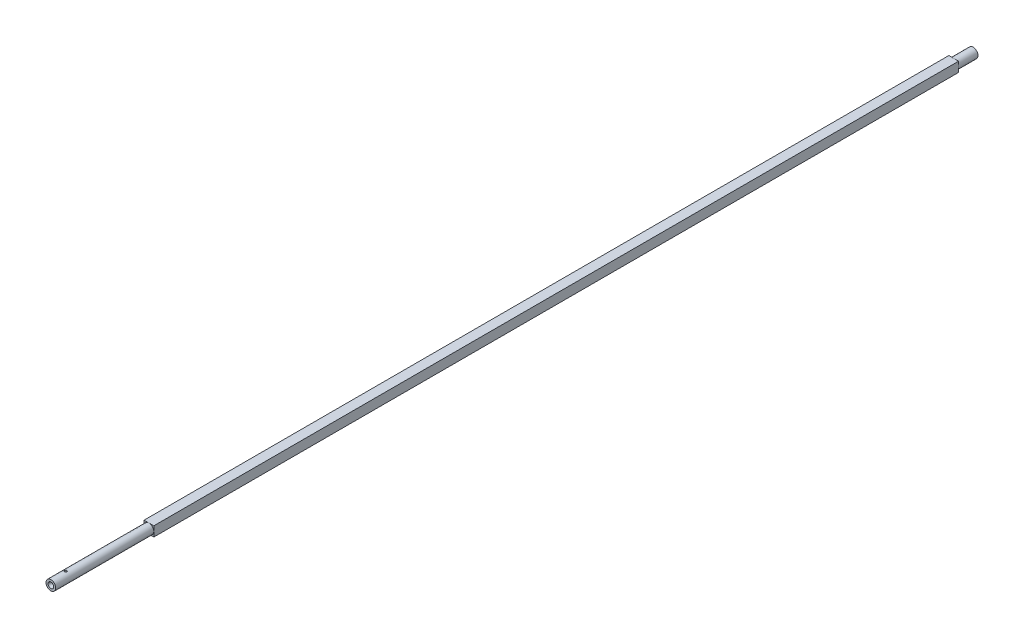
ISO-10303-21;
HEADER;
FILE_DESCRIPTION(('STEP AP214'),'2;1');
FILE_NAME('part.step','',(''),(''),'','','');
FILE_SCHEMA(('AUTOMOTIVE_DESIGN { 1 0 10303 214 1 1 1 1 }'));
ENDSEC;
DATA;
#1=APPLICATION_CONTEXT('core data for automotive mechanical design processes');
#2=APPLICATION_PROTOCOL_DEFINITION('international standard','automotive_design',2000,#1);
#3=PRODUCT_CONTEXT('',#1,'mechanical');
#4=PRODUCT('Part','Part','',(#3));
#5=PRODUCT_RELATED_PRODUCT_CATEGORY('part','',(#4));
#6=PRODUCT_DEFINITION_FORMATION('','',#4);
#7=PRODUCT_DEFINITION_CONTEXT('part definition',#1,'design');
#8=PRODUCT_DEFINITION('design','',#6,#7);
#9=PRODUCT_DEFINITION_SHAPE('','',#8);
#10=(LENGTH_UNIT() NAMED_UNIT(*) SI_UNIT(.MILLI.,.METRE.));
#11=(NAMED_UNIT(*) PLANE_ANGLE_UNIT() SI_UNIT($,.RADIAN.));
#12=(NAMED_UNIT(*) SI_UNIT($,.STERADIAN.) SOLID_ANGLE_UNIT());
#13=UNCERTAINTY_MEASURE_WITH_UNIT(LENGTH_MEASURE(1.E-05),#10,'distance_accuracy_value','');
#14=(GEOMETRIC_REPRESENTATION_CONTEXT(3) GLOBAL_UNCERTAINTY_ASSIGNED_CONTEXT((#13)) GLOBAL_UNIT_ASSIGNED_CONTEXT((#10,
#11,#12)) REPRESENTATION_CONTEXT('',''));
#15=CARTESIAN_POINT('',(0.,0.,0.));
#16=DIRECTION('',(0.,0.,1.));
#17=DIRECTION('',(1.,0.,0.));
#18=AXIS2_PLACEMENT_3D('',#15,#16,#17);
#19=CARTESIAN_POINT('',(0.,0.,0.));
#20=DIRECTION('',(0.,0.,-1.));
#21=DIRECTION('',(-1.,0.,0.));
#22=AXIS2_PLACEMENT_3D('',#19,#20,#21);
#23=CYLINDRICAL_SURFACE('',#22,3.155);
#24=CARTESIAN_POINT('',(0.,0.,-584.64));
#25=DIRECTION('',(0.,0.,-1.));
#26=DIRECTION('',(-1.,0.,0.));
#27=AXIS2_PLACEMENT_3D('',#24,#25,#26);
#28=CIRCLE('',#27,3.155);
#29=CARTESIAN_POINT('',(-3.155,0.,-584.64));
#30=VERTEX_POINT('',#29);
#31=EDGE_CURVE('E11',#30,#30,#28,.F.);
#32=ORIENTED_EDGE('',*,*,#31,.F.);
#33=EDGE_LOOP('',(#32));
#34=FACE_BOUND('',#33,.T.);
#35=CARTESIAN_POINT('',(0.,0.,-597.2));
#36=DIRECTION('',(0.,0.,-1.));
#37=DIRECTION('',(-1.,0.,0.));
#38=AXIS2_PLACEMENT_3D('',#35,#36,#37);
#39=CIRCLE('',#38,3.155);
#40=CARTESIAN_POINT('',(-3.155,0.,-597.2));
#41=VERTEX_POINT('',#40);
#42=EDGE_CURVE('E116',#41,#41,#39,.T.);
#43=ORIENTED_EDGE('',*,*,#42,.F.);
#44=EDGE_LOOP('',(#43));
#45=FACE_BOUND('',#44,.T.);
#46=ADVANCED_FACE('F31',(#34,#45),#23,.T.);
#47=CARTESIAN_POINT('',(0.,1.805,-597.2));
#48=DIRECTION('',(0.,0.,-1.));
#49=DIRECTION('',(-1.,0.,0.));
#50=AXIS2_PLACEMENT_3D('',#47,#48,#49);
#51=PLANE('',#50);
#52=ORIENTED_EDGE('',*,*,#42,.T.);
#53=EDGE_LOOP('',(#52));
#54=FACE_BOUND('',#53,.T.);
#55=CARTESIAN_POINT('',(0.,0.,-597.2));
#56=DIRECTION('',(0.,0.,-1.));
#57=DIRECTION('',(-1.,0.,0.));
#58=AXIS2_PLACEMENT_3D('',#55,#56,#57);
#59=CIRCLE('',#58,1.805);
#60=CARTESIAN_POINT('',(-1.805,0.,-597.2));
#61=VERTEX_POINT('',#60);
#62=EDGE_CURVE('E125',#61,#61,#59,.T.);
#63=ORIENTED_EDGE('',*,*,#62,.F.);
#64=EDGE_LOOP('',(#63));
#65=FACE_BOUND('',#64,.T.);
#66=ADVANCED_FACE('F33',(#54,#65),#51,.T.);
#67=CARTESIAN_POINT('',(0.,0.,-592.2));
#68=DIRECTION('',(0.,0.,-1.));
#69=DIRECTION('',(-1.,0.,0.));
#70=AXIS2_PLACEMENT_3D('',#67,#68,#69);
#71=CONICAL_SURFACE('',#70,0.,0.346440567429859);
#72=ORIENTED_EDGE('',*,*,#62,.T.);
#73=EDGE_LOOP('',(#72));
#74=FACE_BOUND('',#73,.T.);
#75=CARTESIAN_POINT('',(0.,0.,-592.2));
#76=VERTEX_POINT('',#75);
#77=VERTEX_LOOP('',#76);
#78=FACE_BOUND('',#77,.T.);
#79=ADVANCED_FACE('F160',(#74,#78),#71,.F.);
#80=CARTESIAN_POINT('',(0.,0.,-584.64));
#81=DIRECTION('',(0.,0.,-1.));
#82=DIRECTION('',(-1.,0.,0.));
#83=AXIS2_PLACEMENT_3D('',#80,#81,#82);
#84=PLANE('',#83);
#85=ORIENTED_EDGE('',*,*,#31,.T.);
#86=EDGE_LOOP('',(#85));
#87=FACE_BOUND('',#86,.T.);
#88=DIRECTION('',(0.,-1.,0.));
#89=VECTOR('',#88,1.);
#90=CARTESIAN_POINT('',(-3.16,3.16,-584.64));
#91=LINE('',#90,#89);
#92=CARTESIAN_POINT('',(-3.16,3.16,-584.64));
#93=VERTEX_POINT('',#92);
#94=CARTESIAN_POINT('',(-3.16,-3.16,-584.64));
#95=VERTEX_POINT('',#94);
#96=EDGE_CURVE('E109',#93,#95,#91,.T.);
#97=ORIENTED_EDGE('',*,*,#96,.F.);
#98=DIRECTION('',(-1.,0.,0.));
#99=VECTOR('',#98,1.);
#100=CARTESIAN_POINT('',(-3.16,3.16,-584.64));
#101=LINE('',#100,#99);
#102=CARTESIAN_POINT('',(3.16,3.16,-584.64));
#103=VERTEX_POINT('',#102);
#104=EDGE_CURVE('E84',#103,#93,#101,.T.);
#105=ORIENTED_EDGE('',*,*,#104,.F.);
#106=DIRECTION('',(0.,1.,0.));
#107=VECTOR('',#106,1.);
#108=CARTESIAN_POINT('',(3.16,3.16,-584.64));
#109=LINE('',#108,#107);
#110=CARTESIAN_POINT('',(3.16,-3.16,-584.64));
#111=VERTEX_POINT('',#110);
#112=EDGE_CURVE('E77',#111,#103,#109,.T.);
#113=ORIENTED_EDGE('',*,*,#112,.F.);
#114=DIRECTION('',(1.,0.,0.));
#115=VECTOR('',#114,1.);
#116=CARTESIAN_POINT('',(-3.16,-3.16,-584.64));
#117=LINE('',#116,#115);
#118=EDGE_CURVE('E81',#95,#111,#117,.T.);
#119=ORIENTED_EDGE('',*,*,#118,.F.);
#120=EDGE_LOOP('',(#97,#105,#113,#119));
#121=FACE_BOUND('',#120,.T.);
#122=ADVANCED_FACE('F79',(#87,#121),#84,.T.);
#123=CARTESIAN_POINT('',(-3.16,-3.16,-63.5));
#124=DIRECTION('',(0.,0.,1.));
#125=DIRECTION('',(1.,0.,0.));
#126=AXIS2_PLACEMENT_3D('',#123,#124,#125);
#127=PLANE('',#126);
#128=CARTESIAN_POINT('',(0.,0.,-63.5));
#129=DIRECTION('',(0.,0.,1.));
#130=DIRECTION('',(1.,0.,0.));
#131=AXIS2_PLACEMENT_3D('',#128,#129,#130);
#132=CIRCLE('',#131,3.155);
#133=CARTESIAN_POINT('',(3.155,0.,-63.5));
#134=VERTEX_POINT('',#133);
#135=EDGE_CURVE('E44',#134,#134,#132,.F.);
#136=ORIENTED_EDGE('',*,*,#135,.T.);
#137=EDGE_LOOP('',(#136));
#138=FACE_BOUND('',#137,.T.);
#139=DIRECTION('',(0.,-1.,0.));
#140=VECTOR('',#139,1.);
#141=CARTESIAN_POINT('',(-3.16,3.16,-63.5));
#142=LINE('',#141,#140);
#143=CARTESIAN_POINT('',(-3.16,3.16,-63.5));
#144=VERTEX_POINT('',#143);
#145=CARTESIAN_POINT('',(-3.16,-3.16,-63.5));
#146=VERTEX_POINT('',#145);
#147=EDGE_CURVE('E107',#144,#146,#142,.T.);
#148=ORIENTED_EDGE('',*,*,#147,.T.);
#149=DIRECTION('',(1.,0.,0.));
#150=VECTOR('',#149,1.);
#151=CARTESIAN_POINT('',(-3.16,-3.16,-63.5));
#152=LINE('',#151,#150);
#153=CARTESIAN_POINT('',(3.16,-3.16,-63.5));
#154=VERTEX_POINT('',#153);
#155=EDGE_CURVE('E193',#146,#154,#152,.T.);
#156=ORIENTED_EDGE('',*,*,#155,.T.);
#157=DIRECTION('',(0.,1.,0.));
#158=VECTOR('',#157,1.);
#159=CARTESIAN_POINT('',(3.16,3.16,-63.5));
#160=LINE('',#159,#158);
#161=CARTESIAN_POINT('',(3.16,3.16,-63.5));
#162=VERTEX_POINT('',#161);
#163=EDGE_CURVE('E93',#154,#162,#160,.T.);
#164=ORIENTED_EDGE('',*,*,#163,.T.);
#165=DIRECTION('',(-1.,0.,0.));
#166=VECTOR('',#165,1.);
#167=CARTESIAN_POINT('',(-3.16,3.16,-63.5));
#168=LINE('',#167,#166);
#169=EDGE_CURVE('E101',#162,#144,#168,.T.);
#170=ORIENTED_EDGE('',*,*,#169,.T.);
#171=EDGE_LOOP('',(#148,#156,#164,#170));
#172=FACE_BOUND('',#171,.T.);
#173=ADVANCED_FACE('F142',(#138,#172),#127,.T.);
#174=CARTESIAN_POINT('',(-3.16,-3.16,-593.577829714198));
#175=DIRECTION('',(0.,-1.,0.));
#176=DIRECTION('',(0.,0.,-1.));
#177=AXIS2_PLACEMENT_3D('',#174,#175,#176);
#178=PLANE('',#177);
#179=DIRECTION('',(0.,0.,1.));
#180=VECTOR('',#179,1.);
#181=CARTESIAN_POINT('',(-3.16,-3.16,-593.577829714198));
#182=LINE('',#181,#180);
#183=EDGE_CURVE('E100',#95,#146,#182,.T.);
#184=ORIENTED_EDGE('',*,*,#183,.F.);
#185=ORIENTED_EDGE('',*,*,#118,.T.);
#186=DIRECTION('',(0.,0.,1.));
#187=VECTOR('',#186,1.);
#188=CARTESIAN_POINT('',(3.16,-3.16,-593.577829714198));
#189=LINE('',#188,#187);
#190=EDGE_CURVE('E88',#111,#154,#189,.T.);
#191=ORIENTED_EDGE('',*,*,#190,.T.);
#192=ORIENTED_EDGE('',*,*,#155,.F.);
#193=EDGE_LOOP('',(#184,#185,#191,#192));
#194=FACE_BOUND('',#193,.T.);
#195=ADVANCED_FACE('F99',(#194),#178,.T.);
#196=CARTESIAN_POINT('',(3.16,3.16,-593.577829714198));
#197=DIRECTION('',(1.,0.,0.));
#198=DIRECTION('',(0.,0.,-1.));
#199=AXIS2_PLACEMENT_3D('',#196,#197,#198);
#200=PLANE('',#199);
#201=ORIENTED_EDGE('',*,*,#190,.F.);
#202=ORIENTED_EDGE('',*,*,#112,.T.);
#203=DIRECTION('',(0.,0.,1.));
#204=VECTOR('',#203,1.);
#205=CARTESIAN_POINT('',(3.16,3.16,-593.577829714198));
#206=LINE('',#205,#204);
#207=EDGE_CURVE('E87',#103,#162,#206,.T.);
#208=ORIENTED_EDGE('',*,*,#207,.T.);
#209=ORIENTED_EDGE('',*,*,#163,.F.);
#210=EDGE_LOOP('',(#201,#202,#208,#209));
#211=FACE_BOUND('',#210,.T.);
#212=ADVANCED_FACE('F91',(#211),#200,.T.);
#213=CARTESIAN_POINT('',(-3.16,3.16,-593.577829714198));
#214=DIRECTION('',(0.,1.,0.));
#215=DIRECTION('',(0.,0.,1.));
#216=AXIS2_PLACEMENT_3D('',#213,#214,#215);
#217=PLANE('',#216);
#218=ORIENTED_EDGE('',*,*,#207,.F.);
#219=ORIENTED_EDGE('',*,*,#104,.T.);
#220=DIRECTION('',(0.,0.,1.));
#221=VECTOR('',#220,1.);
#222=CARTESIAN_POINT('',(-3.16,3.16,-593.577829714198));
#223=LINE('',#222,#221);
#224=EDGE_CURVE('E111',#93,#144,#223,.T.);
#225=ORIENTED_EDGE('',*,*,#224,.T.);
#226=ORIENTED_EDGE('',*,*,#169,.F.);
#227=EDGE_LOOP('',(#218,#219,#225,#226));
#228=FACE_BOUND('',#227,.T.);
#229=ADVANCED_FACE('F151',(#228),#217,.T.);
#230=CARTESIAN_POINT('',(-3.16,3.16,-593.577829714198));
#231=DIRECTION('',(-1.,0.,0.));
#232=DIRECTION('',(0.,0.,1.));
#233=AXIS2_PLACEMENT_3D('',#230,#231,#232);
#234=PLANE('',#233);
#235=ORIENTED_EDGE('',*,*,#224,.F.);
#236=ORIENTED_EDGE('',*,*,#96,.T.);
#237=ORIENTED_EDGE('',*,*,#183,.T.);
#238=ORIENTED_EDGE('',*,*,#147,.F.);
#239=EDGE_LOOP('',(#235,#236,#237,#238));
#240=FACE_BOUND('',#239,.T.);
#241=ADVANCED_FACE('F147',(#240),#234,.T.);
#242=CARTESIAN_POINT('',(0.,0.,0.));
#243=DIRECTION('',(0.,0.,1.));
#244=DIRECTION('',(1.,0.,0.));
#245=AXIS2_PLACEMENT_3D('',#242,#243,#244);
#246=CONICAL_SURFACE('',#245,1.805,0.34644056742986);
#247=CARTESIAN_POINT('',(0.,0.,-5.));
#248=VERTEX_POINT('',#247);
#249=VERTEX_LOOP('',#248);
#250=FACE_BOUND('',#249,.T.);
#251=CARTESIAN_POINT('',(0.,0.,0.));
#252=DIRECTION('',(0.,0.,-1.));
#253=DIRECTION('',(-1.,0.,0.));
#254=AXIS2_PLACEMENT_3D('',#251,#252,#253);
#255=CIRCLE('',#254,1.805);
#256=CARTESIAN_POINT('',(-1.805,0.,0.));
#257=VERTEX_POINT('',#256);
#258=EDGE_CURVE('E122',#257,#257,#255,.T.);
#259=ORIENTED_EDGE('',*,*,#258,.F.);
#260=EDGE_LOOP('',(#259));
#261=FACE_BOUND('',#260,.T.);
#262=ADVANCED_FACE('F150',(#250,#261),#246,.F.);
#263=CARTESIAN_POINT('',(0.,1.805,0.));
#264=DIRECTION('',(0.,0.,1.));
#265=DIRECTION('',(1.,0.,0.));
#266=AXIS2_PLACEMENT_3D('',#263,#264,#265);
#267=PLANE('',#266);
#268=ORIENTED_EDGE('',*,*,#258,.T.);
#269=EDGE_LOOP('',(#268));
#270=FACE_BOUND('',#269,.T.);
#271=CARTESIAN_POINT('',(0.,0.,0.));
#272=DIRECTION('',(0.,0.,-1.));
#273=DIRECTION('',(-1.,0.,0.));
#274=AXIS2_PLACEMENT_3D('',#271,#272,#273);
#275=CIRCLE('',#274,3.155);
#276=CARTESIAN_POINT('',(-3.155,0.,0.));
#277=VERTEX_POINT('',#276);
#278=EDGE_CURVE('E119',#277,#277,#275,.T.);
#279=ORIENTED_EDGE('',*,*,#278,.F.);
#280=EDGE_LOOP('',(#279));
#281=FACE_BOUND('',#280,.T.);
#282=ADVANCED_FACE('F175',(#270,#281),#267,.T.);
#283=CARTESIAN_POINT('',(0.,-3.155,-8.75));
#284=CARTESIAN_POINT('',(-0.0428434035980631,-3.15499926048428,-8.750001244982));
#285=CARTESIAN_POINT('',(-0.0857008689730953,-3.15411858978365,-8.75356465068409));
#286=CARTESIAN_POINT('',(-0.170189101618843,-3.15069071162757,-8.76770374267047));
#287=CARTESIAN_POINT('',(-0.211819132037601,-3.14814252359348,-8.77828355498113));
#288=CARTESIAN_POINT('',(-0.292620072576789,-3.14166201143922,-8.80609674963331));
#289=CARTESIAN_POINT('',(-0.331793817241806,-3.13773131870047,-8.82332229220053));
#290=CARTESIAN_POINT('',(-0.406695385445942,-3.12890523512157,-8.86391078071691));
#291=CARTESIAN_POINT('',(-0.442423122027188,-3.12400981994672,-8.88727388148817));
#292=CARTESIAN_POINT('',(-0.510130903957558,-3.11367735158938,-8.93996636993879));
#293=CARTESIAN_POINT('',(-0.542032461447433,-3.10823217478582,-8.9693950241511));
#294=CARTESIAN_POINT('',(-0.600500381895772,-3.09746832578943,-9.03317063330392));
#295=CARTESIAN_POINT('',(-0.627066162448743,-3.092149667462,-9.06751812444034));
#296=CARTESIAN_POINT('',(-0.674474185695772,-3.082159435371,-9.14076155942961));
#297=CARTESIAN_POINT('',(-0.695229253223514,-3.07749818972667,-9.17971546529679));
#298=CARTESIAN_POINT('',(-0.729866294223732,-3.06946876016744,-9.26069230961888));
#299=CARTESIAN_POINT('',(-0.743749324909623,-3.06610037737283,-9.30271477485583));
#300=CARTESIAN_POINT('',(-0.763981667633036,-3.06112144443012,-9.3877744619858));
#301=CARTESIAN_POINT('',(-0.770471795620138,-3.05947808637917,-9.43077622481011));
#302=CARTESIAN_POINT('',(-0.776172614536866,-3.05803702007451,-9.51728718352968));
#303=CARTESIAN_POINT('',(-0.775384446346082,-3.05823902255879,-9.56079629882914));
#304=CARTESIAN_POINT('',(-0.7666635384068,-3.06043633103727,-9.64601252263414));
#305=CARTESIAN_POINT('',(-0.758897963327657,-3.06238967605257,-9.68773798874928));
#306=CARTESIAN_POINT('',(-0.736709073607199,-3.06780278377903,-9.76927502225141));
#307=CARTESIAN_POINT('',(-0.722285299303879,-3.07126265049497,-9.8090864572899));
#308=CARTESIAN_POINT('',(-0.687045395789382,-3.07933788839243,-9.88611674135006));
#309=CARTESIAN_POINT('',(-0.666168073404985,-3.0839642393672,-9.9233063963252));
#310=CARTESIAN_POINT('',(-0.618656532309678,-3.09384489758779,-9.99371478724897));
#311=CARTESIAN_POINT('',(-0.59202133837436,-3.09909931114258,-10.0269328490374));
#312=CARTESIAN_POINT('',(-0.532881439131853,-3.10982123069661,-10.0894137565276));
#313=CARTESIAN_POINT('',(-0.50023550262805,-3.11529062373362,-10.1185427618528));
#314=CARTESIAN_POINT('',(-0.430457000832696,-3.12569579383268,-10.1709375582826));
#315=CARTESIAN_POINT('',(-0.393324307698851,-3.13063155568223,-10.194203182262));
#316=CARTESIAN_POINT('',(-0.315439460001193,-3.13943654001289,-10.2342575311372));
#317=CARTESIAN_POINT('',(-0.274676023963122,-3.14330227322214,-10.2510251360273));
#318=CARTESIAN_POINT('',(-0.190793091323866,-3.14950620185087,-10.2774330145553));
#319=CARTESIAN_POINT('',(-0.147674030965762,-3.15184467907395,-10.2870746031024));
#320=CARTESIAN_POINT('',(-0.0614486931992691,-3.15468914288634,-10.2987537936721));
#321=CARTESIAN_POINT('',(-0.0183685274254403,-3.1552390632046,-10.3009737383057));
#322=CARTESIAN_POINT('',(0.0675476236497084,-3.15456928701989,-10.2982458770324));
#323=CARTESIAN_POINT('',(0.110383629799755,-3.15334974395432,-10.2932986926166));
#324=CARTESIAN_POINT('',(0.19396619774073,-3.14930616413586,-10.2765274620546));
#325=CARTESIAN_POINT('',(0.234733825093927,-3.14650521900656,-10.2648023299178));
#326=CARTESIAN_POINT('',(0.313721801449213,-3.13961412652607,-10.2349205490532));
#327=CARTESIAN_POINT('',(0.351941898010841,-3.13552385164175,-10.2167632640715));
#328=CARTESIAN_POINT('',(0.425479583921592,-3.12640207341987,-10.174175351874));
#329=CARTESIAN_POINT('',(0.460735692863987,-3.12135554355748,-10.1496418598766));
#330=CARTESIAN_POINT('',(0.526695422691907,-3.11090566670998,-10.0951299979377));
#331=CARTESIAN_POINT('',(0.557398284994117,-3.10550226048454,-10.0651507225608));
#332=CARTESIAN_POINT('',(0.614127020455051,-3.09479039352678,-9.99975294858688));
#333=CARTESIAN_POINT('',(0.640025199323585,-3.08948719539553,-9.96422263904472));
#334=CARTESIAN_POINT('',(0.685490746342258,-3.07971919430867,-9.8892121609344));
#335=CARTESIAN_POINT('',(0.705058397210639,-3.07525435391616,-9.84973216886023));
#336=CARTESIAN_POINT('',(0.737162929617571,-3.06771704697937,-9.76815665757487));
#337=CARTESIAN_POINT('',(0.749741449844653,-3.0646363557007,-9.72607832488666));
#338=CARTESIAN_POINT('',(0.767622634584384,-3.0602070090432,-9.64031736986581));
#339=CARTESIAN_POINT('',(0.772926825028734,-3.05885799041626,-9.59663508596768));
#340=CARTESIAN_POINT('',(0.776031146509618,-3.05807173201391,-9.51020375345234));
#341=CARTESIAN_POINT('',(0.774035107202724,-3.05858256160971,-9.46746237884118));
#342=CARTESIAN_POINT('',(0.763060538255978,-3.06133876001959,-9.38294559547487));
#343=CARTESIAN_POINT('',(0.754082139670099,-3.06358409627821,-9.3411701686047));
#344=CARTESIAN_POINT('',(0.729507243124497,-3.06952788434703,-9.25998398575286));
#345=CARTESIAN_POINT('',(0.713947723814152,-3.07321820844354,-9.22056140066111));
#346=CARTESIAN_POINT('',(0.67668174921646,-3.08163757135176,-9.14485867785465));
#347=CARTESIAN_POINT('',(0.654974470875102,-3.08636674922484,-9.10857896175302));
#348=CARTESIAN_POINT('',(0.605384741907683,-3.09648008399222,-9.03920389077705));
#349=CARTESIAN_POINT('',(0.577360283757083,-3.10187775774647,-9.00621199672671));
#350=CARTESIAN_POINT('',(0.516210101989478,-3.11263781553505,-8.94533281003236));
#351=CARTESIAN_POINT('',(0.483083174866335,-3.1180001909317,-8.91744672508752));
#352=CARTESIAN_POINT('',(0.41197605037596,-3.12819619645481,-8.86710096801347));
#353=CARTESIAN_POINT('',(0.373921741092804,-3.13301906187442,-8.84474363076846));
#354=CARTESIAN_POINT('',(0.294480382839361,-3.14148001054233,-8.80677912439522));
#355=CARTESIAN_POINT('',(0.253095809905178,-3.14511896405557,-8.79116699424745));
#356=CARTESIAN_POINT('',(0.176472252043095,-3.15024746023148,-8.76952299632693));
#357=CARTESIAN_POINT('',(0.141606284601715,-3.15201760271578,-8.76221741312907));
#358=CARTESIAN_POINT('',(0.0711634120339068,-3.1543941390154,-8.75245556756162));
#359=CARTESIAN_POINT('',(0.0355865568264531,-3.15500061425601,-8.74999896589395));
#360=CARTESIAN_POINT('',(0.,-3.155,-8.75));
#361=B_SPLINE_CURVE_WITH_KNOTS('',3,(#283,#284,#285,#286,#287,#288,#289,#290,#291,#292,#293,
#294,#295,#296,#297,#298,#299,#300,#301,#302,#303,#304,#305,#306,#307,#308,#309,#310,#311,#312,
#313,#314,#315,#316,#317,#318,#319,#320,#321,#322,#323,#324,#325,#326,#327,#328,#329,#330,#331,
#332,#333,#334,#335,#336,#337,#338,#339,#340,#341,#342,#343,#344,#345,#346,#347,#348,#349,#350,
#351,#352,#353,#354,#355,#356,#357,#358,#359,#360),.UNSPECIFIED.,.T.,.F.,(4,2,2,2,2,2,2,2,2,2,2,
2,2,2,2,2,2,2,2,2,2,2,2,2,2,2,2,2,2,2,2,2,2,2,2,2,2,2,4),(0.,0.128399821935008,
0.256875216937389,0.385199514403917,0.513527049207639,0.644150540445591,0.774788281631845,
0.907292049588053,1.03977542645266,1.1696907692188,1.29958574798176,1.42644932142467,
1.55332165445644,1.6814359524321,1.80957196645618,1.94123062996795,2.07289304574837,
2.20497987471763,2.3370423246252,2.46583530198566,2.59461711184787,2.72156535647552,
2.84852616204127,2.97767822314939,3.10685177722886,3.23907840362816,3.37129912403645,
3.50272343601715,3.63412017498147,3.76187654884373,3.88963052486656,4.01667600564361,
4.14373850315175,4.27400743179467,4.40430713381773,4.53686330216086,4.6693218103635,
4.7759806408528,4.8826320078325),.UNSPECIFIED.);
#362=CARTESIAN_POINT('',(0.,-3.155,-8.75));
#363=VERTEX_POINT('',#362);
#364=EDGE_CURVE('E35',#363,#363,#361,.T.);
#365=ORIENTED_EDGE('',*,*,#364,.F.);
#366=EDGE_LOOP('',(#365));
#367=FACE_BOUND('',#366,.T.);
#368=CARTESIAN_POINT('',(0.,3.155,-8.75));
#369=CARTESIAN_POINT('',(0.0428434035980631,3.15499926048428,-8.750001244982));
#370=CARTESIAN_POINT('',(0.0857008689730953,3.15411858978365,-8.75356465068409));
#371=CARTESIAN_POINT('',(0.170189101618843,3.15069071162757,-8.76770374267047));
#372=CARTESIAN_POINT('',(0.211819132037601,3.14814252359348,-8.77828355498113));
#373=CARTESIAN_POINT('',(0.292620072576789,3.14166201143922,-8.80609674963331));
#374=CARTESIAN_POINT('',(0.331793817241806,3.13773131870047,-8.82332229220053));
#375=CARTESIAN_POINT('',(0.406695385445942,3.12890523512157,-8.86391078071691));
#376=CARTESIAN_POINT('',(0.442423122027188,3.12400981994672,-8.88727388148817));
#377=CARTESIAN_POINT('',(0.510130903957558,3.11367735158938,-8.93996636993879));
#378=CARTESIAN_POINT('',(0.542032461447433,3.10823217478582,-8.9693950241511));
#379=CARTESIAN_POINT('',(0.600500381895772,3.09746832578943,-9.03317063330392));
#380=CARTESIAN_POINT('',(0.627066162448743,3.092149667462,-9.06751812444034));
#381=CARTESIAN_POINT('',(0.674474185695772,3.082159435371,-9.14076155942961));
#382=CARTESIAN_POINT('',(0.695229253223514,3.07749818972667,-9.17971546529679));
#383=CARTESIAN_POINT('',(0.729866294223732,3.06946876016744,-9.26069230961888));
#384=CARTESIAN_POINT('',(0.743749324909623,3.06610037737283,-9.30271477485583));
#385=CARTESIAN_POINT('',(0.763981667633036,3.06112144443012,-9.3877744619858));
#386=CARTESIAN_POINT('',(0.770471795620138,3.05947808637917,-9.43077622481011));
#387=CARTESIAN_POINT('',(0.776172614536866,3.05803702007451,-9.51728718352968));
#388=CARTESIAN_POINT('',(0.775384446346082,3.05823902255879,-9.56079629882914));
#389=CARTESIAN_POINT('',(0.7666635384068,3.06043633103727,-9.64601252263414));
#390=CARTESIAN_POINT('',(0.758897963327657,3.06238967605257,-9.68773798874928));
#391=CARTESIAN_POINT('',(0.736709073607199,3.06780278377903,-9.76927502225141));
#392=CARTESIAN_POINT('',(0.722285299303879,3.07126265049497,-9.8090864572899));
#393=CARTESIAN_POINT('',(0.687045395789382,3.07933788839243,-9.88611674135006));
#394=CARTESIAN_POINT('',(0.666168073404985,3.0839642393672,-9.9233063963252));
#395=CARTESIAN_POINT('',(0.618656532309678,3.09384489758779,-9.99371478724897));
#396=CARTESIAN_POINT('',(0.59202133837436,3.09909931114258,-10.0269328490374));
#397=CARTESIAN_POINT('',(0.532881439131853,3.10982123069661,-10.0894137565276));
#398=CARTESIAN_POINT('',(0.50023550262805,3.11529062373362,-10.1185427618528));
#399=CARTESIAN_POINT('',(0.430457000832696,3.12569579383268,-10.1709375582826));
#400=CARTESIAN_POINT('',(0.393324307698851,3.13063155568223,-10.194203182262));
#401=CARTESIAN_POINT('',(0.315439460001193,3.13943654001289,-10.2342575311372));
#402=CARTESIAN_POINT('',(0.274676023963122,3.14330227322214,-10.2510251360273));
#403=CARTESIAN_POINT('',(0.190793091323866,3.14950620185087,-10.2774330145553));
#404=CARTESIAN_POINT('',(0.147674030965762,3.15184467907395,-10.2870746031024));
#405=CARTESIAN_POINT('',(0.0614486931992691,3.15468914288634,-10.2987537936721));
#406=CARTESIAN_POINT('',(0.0183685274254403,3.1552390632046,-10.3009737383057));
#407=CARTESIAN_POINT('',(-0.0675476236497084,3.15456928701989,-10.2982458770324));
#408=CARTESIAN_POINT('',(-0.110383629799755,3.15334974395432,-10.2932986926166));
#409=CARTESIAN_POINT('',(-0.19396619774073,3.14930616413586,-10.2765274620546));
#410=CARTESIAN_POINT('',(-0.234733825093927,3.14650521900656,-10.2648023299178));
#411=CARTESIAN_POINT('',(-0.313721801449213,3.13961412652607,-10.2349205490532));
#412=CARTESIAN_POINT('',(-0.351941898010841,3.13552385164175,-10.2167632640715));
#413=CARTESIAN_POINT('',(-0.425479583921592,3.12640207341987,-10.174175351874));
#414=CARTESIAN_POINT('',(-0.460735692863987,3.12135554355748,-10.1496418598766));
#415=CARTESIAN_POINT('',(-0.526695422691907,3.11090566670998,-10.0951299979377));
#416=CARTESIAN_POINT('',(-0.557398284994117,3.10550226048454,-10.0651507225608));
#417=CARTESIAN_POINT('',(-0.614127020455051,3.09479039352678,-9.99975294858688));
#418=CARTESIAN_POINT('',(-0.640025199323585,3.08948719539553,-9.96422263904472));
#419=CARTESIAN_POINT('',(-0.685490746342258,3.07971919430867,-9.8892121609344));
#420=CARTESIAN_POINT('',(-0.705058397210639,3.07525435391616,-9.84973216886023));
#421=CARTESIAN_POINT('',(-0.737162929617571,3.06771704697937,-9.76815665757487));
#422=CARTESIAN_POINT('',(-0.749741449844653,3.0646363557007,-9.72607832488666));
#423=CARTESIAN_POINT('',(-0.767622634584384,3.0602070090432,-9.64031736986581));
#424=CARTESIAN_POINT('',(-0.772926825028734,3.05885799041626,-9.59663508596768));
#425=CARTESIAN_POINT('',(-0.776031146509618,3.05807173201391,-9.51020375345234));
#426=CARTESIAN_POINT('',(-0.774035107202724,3.05858256160971,-9.46746237884118));
#427=CARTESIAN_POINT('',(-0.763060538255978,3.06133876001959,-9.38294559547487));
#428=CARTESIAN_POINT('',(-0.754082139670099,3.06358409627821,-9.3411701686047));
#429=CARTESIAN_POINT('',(-0.729507243124497,3.06952788434703,-9.25998398575286));
#430=CARTESIAN_POINT('',(-0.713947723814152,3.07321820844354,-9.22056140066111));
#431=CARTESIAN_POINT('',(-0.67668174921646,3.08163757135176,-9.14485867785465));
#432=CARTESIAN_POINT('',(-0.654974470875102,3.08636674922484,-9.10857896175302));
#433=CARTESIAN_POINT('',(-0.605384741907683,3.09648008399222,-9.03920389077705));
#434=CARTESIAN_POINT('',(-0.577360283757083,3.10187775774647,-9.00621199672671));
#435=CARTESIAN_POINT('',(-0.516210101989478,3.11263781553505,-8.94533281003236));
#436=CARTESIAN_POINT('',(-0.483083174866335,3.1180001909317,-8.91744672508752));
#437=CARTESIAN_POINT('',(-0.41197605037596,3.12819619645481,-8.86710096801347));
#438=CARTESIAN_POINT('',(-0.373921741092804,3.13301906187442,-8.84474363076846));
#439=CARTESIAN_POINT('',(-0.294480382839361,3.14148001054233,-8.80677912439522));
#440=CARTESIAN_POINT('',(-0.253095809905178,3.14511896405557,-8.79116699424745));
#441=CARTESIAN_POINT('',(-0.176472252043095,3.15024746023148,-8.76952299632693));
#442=CARTESIAN_POINT('',(-0.141606284601715,3.15201760271578,-8.76221741312907));
#443=CARTESIAN_POINT('',(-0.0711634120339068,3.1543941390154,-8.75245556756162));
#444=CARTESIAN_POINT('',(-0.0355865568264531,3.15500061425601,-8.74999896589395));
#445=CARTESIAN_POINT('',(0.,3.155,-8.75));
#446=B_SPLINE_CURVE_WITH_KNOTS('',3,(#368,#369,#370,#371,#372,#373,#374,#375,#376,#377,#378,
#379,#380,#381,#382,#383,#384,#385,#386,#387,#388,#389,#390,#391,#392,#393,#394,#395,#396,#397,
#398,#399,#400,#401,#402,#403,#404,#405,#406,#407,#408,#409,#410,#411,#412,#413,#414,#415,#416,
#417,#418,#419,#420,#421,#422,#423,#424,#425,#426,#427,#428,#429,#430,#431,#432,#433,#434,#435,
#436,#437,#438,#439,#440,#441,#442,#443,#444,#445),.UNSPECIFIED.,.T.,.F.,(4,2,2,2,2,2,2,2,2,2,2,
2,2,2,2,2,2,2,2,2,2,2,2,2,2,2,2,2,2,2,2,2,2,2,2,2,2,2,4),(0.,0.128399821935008,
0.256875216937389,0.385199514403917,0.513527049207639,0.644150540445591,0.774788281631845,
0.907292049588053,1.03977542645266,1.1696907692188,1.29958574798176,1.42644932142467,
1.55332165445644,1.6814359524321,1.80957196645618,1.94123062996795,2.07289304574837,
2.20497987471763,2.3370423246252,2.46583530198566,2.59461711184787,2.72156535647552,
2.84852616204127,2.97767822314939,3.10685177722886,3.23907840362816,3.37129912403645,
3.50272343601715,3.63412017498147,3.76187654884373,3.88963052486656,4.01667600564361,
4.14373850315175,4.27400743179467,4.40430713381773,4.53686330216086,4.6693218103635,
4.7759806408528,4.8826320078325),.UNSPECIFIED.);
#447=CARTESIAN_POINT('',(0.,3.155,-8.75));
#448=VERTEX_POINT('',#447);
#449=EDGE_CURVE('E129',#448,#448,#446,.T.);
#450=ORIENTED_EDGE('',*,*,#449,.F.);
#451=EDGE_LOOP('',(#450));
#452=FACE_BOUND('',#451,.T.);
#453=ORIENTED_EDGE('',*,*,#135,.F.);
#454=EDGE_LOOP('',(#453));
#455=FACE_BOUND('',#454,.T.);
#456=ORIENTED_EDGE('',*,*,#278,.T.);
#457=EDGE_LOOP('',(#456));
#458=FACE_BOUND('',#457,.T.);
#459=ADVANCED_FACE('F133',(#367,#452,#455,#458),#23,.T.);
#460=CARTESIAN_POINT('',(0.,-3.16,-9.525));
#461=DIRECTION('',(0.,1.,0.));
#462=DIRECTION('',(0.,0.,1.));
#463=AXIS2_PLACEMENT_3D('',#460,#461,#462);
#464=CYLINDRICAL_SURFACE('',#463,0.775000000000001);
#465=ORIENTED_EDGE('',*,*,#364,.T.);
#466=EDGE_LOOP('',(#465));
#467=FACE_BOUND('',#466,.T.);
#468=ORIENTED_EDGE('',*,*,#449,.T.);
#469=EDGE_LOOP('',(#468));
#470=FACE_BOUND('',#469,.T.);
#471=ADVANCED_FACE('F137',(#467,#470),#464,.F.);
#472=CLOSED_SHELL('',(#46,#66,#79,#122,#173,#195,#212,#229,#241,#262,#282,#459,#471));
#473=MANIFOLD_SOLID_BREP('B2',#472);
#474=ADVANCED_BREP_SHAPE_REPRESENTATION('',(#18,#473),#14);
#475=SHAPE_DEFINITION_REPRESENTATION(#9,#474);
ENDSEC;
END-ISO-10303-21;
